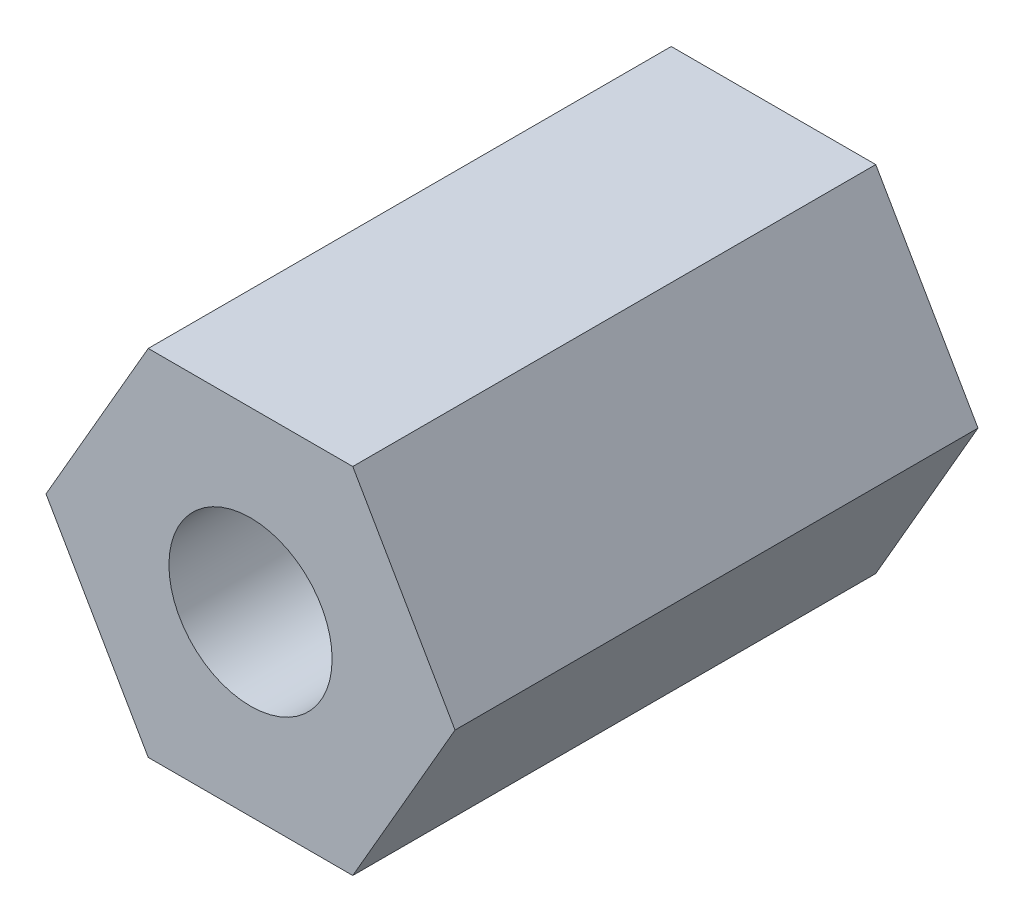
ISO-10303-21;
HEADER;
FILE_DESCRIPTION(('STEP AP214'),'2;1');
FILE_NAME('part.step','',(''),(''),'','','');
FILE_SCHEMA(('AUTOMOTIVE_DESIGN { 1 0 10303 214 1 1 1 1 }'));
ENDSEC;
DATA;
#1=APPLICATION_CONTEXT('core data for automotive mechanical design processes');
#2=APPLICATION_PROTOCOL_DEFINITION('international standard','automotive_design',2000,#1);
#3=PRODUCT_CONTEXT('',#1,'mechanical');
#4=PRODUCT('Part','Part','',(#3));
#5=PRODUCT_RELATED_PRODUCT_CATEGORY('part','',(#4));
#6=PRODUCT_DEFINITION_FORMATION('','',#4);
#7=PRODUCT_DEFINITION_CONTEXT('part definition',#1,'design');
#8=PRODUCT_DEFINITION('design','',#6,#7);
#9=PRODUCT_DEFINITION_SHAPE('','',#8);
#10=(LENGTH_UNIT() NAMED_UNIT(*) SI_UNIT(.MILLI.,.METRE.));
#11=(NAMED_UNIT(*) PLANE_ANGLE_UNIT() SI_UNIT($,.RADIAN.));
#12=(NAMED_UNIT(*) SI_UNIT($,.STERADIAN.) SOLID_ANGLE_UNIT());
#13=UNCERTAINTY_MEASURE_WITH_UNIT(LENGTH_MEASURE(1.E-05),#10,'distance_accuracy_value','');
#14=(GEOMETRIC_REPRESENTATION_CONTEXT(3) GLOBAL_UNCERTAINTY_ASSIGNED_CONTEXT((#13)) GLOBAL_UNIT_ASSIGNED_CONTEXT((#10,
#11,#12)) REPRESENTATION_CONTEXT('',''));
#15=CARTESIAN_POINT('',(0.,0.,0.));
#16=DIRECTION('',(0.,0.,1.));
#17=DIRECTION('',(1.,0.,0.));
#18=AXIS2_PLACEMENT_3D('',#15,#16,#17);
#19=CARTESIAN_POINT('',(0.,0.,-1.01835));
#20=DIRECTION('',(0.,0.,1.));
#21=DIRECTION('',(-1.,0.,0.));
#22=AXIS2_PLACEMENT_3D('',#19,#20,#21);
#23=CYLINDRICAL_SURFACE('',#22,1.025);
#24=CARTESIAN_POINT('',(0.,0.,0.));
#25=DIRECTION('',(0.,0.,1.));
#26=DIRECTION('',(-1.,0.,0.));
#27=AXIS2_PLACEMENT_3D('',#24,#25,#26);
#28=CIRCLE('',#27,1.025);
#29=CARTESIAN_POINT('',(-1.025,0.,0.));
#30=VERTEX_POINT('',#29);
#31=CARTESIAN_POINT('',(1.025,0.,0.));
#32=VERTEX_POINT('',#31);
#33=EDGE_CURVE('E108',#30,#32,#28,.T.);
#34=ORIENTED_EDGE('',*,*,#33,.F.);
#35=CARTESIAN_POINT('',(0.,0.,0.));
#36=DIRECTION('',(0.,0.,1.));
#37=DIRECTION('',(-1.,0.,0.));
#38=AXIS2_PLACEMENT_3D('',#35,#36,#37);
#39=CIRCLE('',#38,1.025);
#40=EDGE_CURVE('E104',#32,#30,#39,.T.);
#41=ORIENTED_EDGE('',*,*,#40,.F.);
#42=DIRECTION('',(0.,0.,1.));
#43=VECTOR('',#42,1.);
#44=CARTESIAN_POINT('',(1.025,0.,-1.01835));
#45=LINE('',#44,#43);
#46=CARTESIAN_POINT('',(1.025,0.,6.57));
#47=VERTEX_POINT('',#46);
#48=EDGE_CURVE('E11',#32,#47,#45,.T.);
#49=ORIENTED_EDGE('',*,*,#48,.T.);
#50=CARTESIAN_POINT('',(0.,0.,6.57));
#51=DIRECTION('',(0.,0.,1.));
#52=DIRECTION('',(-1.,0.,0.));
#53=AXIS2_PLACEMENT_3D('',#50,#51,#52);
#54=CIRCLE('',#53,1.025);
#55=CARTESIAN_POINT('',(-1.025,0.,6.57));
#56=VERTEX_POINT('',#55);
#57=EDGE_CURVE('E20',#47,#56,#54,.T.);
#58=ORIENTED_EDGE('',*,*,#57,.T.);
#59=CARTESIAN_POINT('',(0.,0.,6.57));
#60=DIRECTION('',(0.,0.,1.));
#61=DIRECTION('',(-1.,0.,0.));
#62=AXIS2_PLACEMENT_3D('',#59,#60,#61);
#63=CIRCLE('',#62,1.025);
#64=EDGE_CURVE('E155',#56,#47,#63,.T.);
#65=ORIENTED_EDGE('',*,*,#64,.T.);
#66=ORIENTED_EDGE('',*,*,#48,.F.);
#67=EDGE_LOOP('',(#34,#41,#49,#58,#65,#66));
#68=FACE_BOUND('',#67,.T.);
#69=ADVANCED_FACE('F16',(#68),#23,.F.);
#70=CARTESIAN_POINT('',(0.,0.,6.57));
#71=DIRECTION('',(0.,0.,1.));
#72=DIRECTION('',(1.,0.,0.));
#73=AXIS2_PLACEMENT_3D('',#70,#71,#72);
#74=PLANE('',#73);
#75=ORIENTED_EDGE('',*,*,#64,.F.);
#76=ORIENTED_EDGE('',*,*,#57,.F.);
#77=EDGE_LOOP('',(#75,#76));
#78=FACE_BOUND('',#77,.T.);
#79=DIRECTION('',(0.500000000000017,-0.866025403784429,0.));
#80=VECTOR('',#79,1.);
#81=CARTESIAN_POINT('',(-2.569208697894,0.,6.57));
#82=LINE('',#81,#80);
#83=CARTESIAN_POINT('',(-2.569208697894,0.,6.57));
#84=VERTEX_POINT('',#83);
#85=CARTESIAN_POINT('',(-1.284604348947,-2.225,6.57));
#86=VERTEX_POINT('',#85);
#87=EDGE_CURVE('E141',#84,#86,#82,.T.);
#88=ORIENTED_EDGE('',*,*,#87,.T.);
#89=DIRECTION('',(1.,0.,0.));
#90=VECTOR('',#89,1.);
#91=CARTESIAN_POINT('',(-1.284604348947,-2.225,6.57));
#92=LINE('',#91,#90);
#93=CARTESIAN_POINT('',(1.284604348947,-2.225,6.57));
#94=VERTEX_POINT('',#93);
#95=EDGE_CURVE('E151',#86,#94,#92,.T.);
#96=ORIENTED_EDGE('',*,*,#95,.T.);
#97=DIRECTION('',(0.500000000000017,0.866025403784429,0.));
#98=VECTOR('',#97,1.);
#99=CARTESIAN_POINT('',(1.284604348947,-2.225,6.57));
#100=LINE('',#99,#98);
#101=CARTESIAN_POINT('',(2.569208697894,0.,6.57));
#102=VERTEX_POINT('',#101);
#103=EDGE_CURVE('E180',#94,#102,#100,.T.);
#104=ORIENTED_EDGE('',*,*,#103,.T.);
#105=DIRECTION('',(-0.500000000000017,0.866025403784429,0.));
#106=VECTOR('',#105,1.);
#107=CARTESIAN_POINT('',(2.569208697894,0.,6.57));
#108=LINE('',#107,#106);
#109=CARTESIAN_POINT('',(1.284604348947,2.225,6.57));
#110=VERTEX_POINT('',#109);
#111=EDGE_CURVE('E52',#102,#110,#108,.T.);
#112=ORIENTED_EDGE('',*,*,#111,.T.);
#113=DIRECTION('',(-1.,0.,0.));
#114=VECTOR('',#113,1.);
#115=CARTESIAN_POINT('',(1.284604348947,2.225,6.57));
#116=LINE('',#115,#114);
#117=CARTESIAN_POINT('',(-1.284604348947,2.225,6.57));
#118=VERTEX_POINT('',#117);
#119=EDGE_CURVE('E64',#110,#118,#116,.T.);
#120=ORIENTED_EDGE('',*,*,#119,.T.);
#121=DIRECTION('',(-0.500000000000017,-0.866025403784429,0.));
#122=VECTOR('',#121,1.);
#123=CARTESIAN_POINT('',(-1.284604348947,2.225,6.57));
#124=LINE('',#123,#122);
#125=EDGE_CURVE('E124',#118,#84,#124,.T.);
#126=ORIENTED_EDGE('',*,*,#125,.T.);
#127=EDGE_LOOP('',(#88,#96,#104,#112,#120,#126));
#128=FACE_BOUND('',#127,.T.);
#129=ADVANCED_FACE('F193',(#78,#128),#74,.T.);
#130=CARTESIAN_POINT('',(-1.284604348947,-2.225,0.));
#131=DIRECTION('',(0.,-1.,0.));
#132=DIRECTION('',(0.,0.,-1.));
#133=AXIS2_PLACEMENT_3D('',#130,#131,#132);
#134=PLANE('',#133);
#135=DIRECTION('',(1.,0.,0.));
#136=VECTOR('',#135,1.);
#137=CARTESIAN_POINT('',(-1.284604348947,-2.225,0.));
#138=LINE('',#137,#136);
#139=CARTESIAN_POINT('',(-1.284604348947,-2.225,0.));
#140=VERTEX_POINT('',#139);
#141=CARTESIAN_POINT('',(1.284604348947,-2.225,0.));
#142=VERTEX_POINT('',#141);
#143=EDGE_CURVE('E114',#140,#142,#138,.T.);
#144=ORIENTED_EDGE('',*,*,#143,.T.);
#145=DIRECTION('',(0.,0.,1.));
#146=VECTOR('',#145,1.);
#147=CARTESIAN_POINT('',(1.284604348947,-2.225,0.));
#148=LINE('',#147,#146);
#149=EDGE_CURVE('E156',#142,#94,#148,.T.);
#150=ORIENTED_EDGE('',*,*,#149,.T.);
#151=ORIENTED_EDGE('',*,*,#95,.F.);
#152=DIRECTION('',(0.,0.,1.));
#153=VECTOR('',#152,1.);
#154=CARTESIAN_POINT('',(-1.284604348947,-2.225,0.));
#155=LINE('',#154,#153);
#156=EDGE_CURVE('E110',#140,#86,#155,.T.);
#157=ORIENTED_EDGE('',*,*,#156,.F.);
#158=EDGE_LOOP('',(#144,#150,#151,#157));
#159=FACE_BOUND('',#158,.T.);
#160=ADVANCED_FACE('F189',(#159),#134,.T.);
#161=CARTESIAN_POINT('',(1.284604348947,-2.225,0.));
#162=DIRECTION('',(0.866025403784429,-0.500000000000017,0.));
#163=DIRECTION('',(0.,0.,-1.));
#164=AXIS2_PLACEMENT_3D('',#161,#162,#163);
#165=PLANE('',#164);
#166=DIRECTION('',(0.500000000000017,0.866025403784429,0.));
#167=VECTOR('',#166,1.);
#168=CARTESIAN_POINT('',(1.284604348947,-2.225,0.));
#169=LINE('',#168,#167);
#170=CARTESIAN_POINT('',(2.569208697894,0.,0.));
#171=VERTEX_POINT('',#170);
#172=EDGE_CURVE('E120',#142,#171,#169,.T.);
#173=ORIENTED_EDGE('',*,*,#172,.T.);
#174=DIRECTION('',(0.,0.,1.));
#175=VECTOR('',#174,1.);
#176=CARTESIAN_POINT('',(2.569208697894,0.,0.));
#177=LINE('',#176,#175);
#178=EDGE_CURVE('E150',#171,#102,#177,.T.);
#179=ORIENTED_EDGE('',*,*,#178,.T.);
#180=ORIENTED_EDGE('',*,*,#103,.F.);
#181=ORIENTED_EDGE('',*,*,#149,.F.);
#182=EDGE_LOOP('',(#173,#179,#180,#181));
#183=FACE_BOUND('',#182,.T.);
#184=ADVANCED_FACE('F18',(#183),#165,.T.);
#185=CARTESIAN_POINT('',(2.569208697894,0.,0.));
#186=DIRECTION('',(0.866025403784429,0.500000000000017,0.));
#187=DIRECTION('',(0.,0.,-1.));
#188=AXIS2_PLACEMENT_3D('',#185,#186,#187);
#189=PLANE('',#188);
#190=DIRECTION('',(-0.500000000000017,0.866025403784429,0.));
#191=VECTOR('',#190,1.);
#192=CARTESIAN_POINT('',(2.569208697894,0.,0.));
#193=LINE('',#192,#191);
#194=CARTESIAN_POINT('',(1.284604348947,2.225,0.));
#195=VERTEX_POINT('',#194);
#196=EDGE_CURVE('E134',#171,#195,#193,.T.);
#197=ORIENTED_EDGE('',*,*,#196,.T.);
#198=DIRECTION('',(0.,0.,1.));
#199=VECTOR('',#198,1.);
#200=CARTESIAN_POINT('',(1.284604348947,2.225,0.));
#201=LINE('',#200,#199);
#202=EDGE_CURVE('E144',#195,#110,#201,.T.);
#203=ORIENTED_EDGE('',*,*,#202,.T.);
#204=ORIENTED_EDGE('',*,*,#111,.F.);
#205=ORIENTED_EDGE('',*,*,#178,.F.);
#206=EDGE_LOOP('',(#197,#203,#204,#205));
#207=FACE_BOUND('',#206,.T.);
#208=ADVANCED_FACE('F217',(#207),#189,.T.);
#209=CARTESIAN_POINT('',(1.284604348947,2.225,0.));
#210=DIRECTION('',(0.,1.,0.));
#211=DIRECTION('',(1.,0.,0.));
#212=AXIS2_PLACEMENT_3D('',#209,#210,#211);
#213=PLANE('',#212);
#214=DIRECTION('',(-1.,0.,0.));
#215=VECTOR('',#214,1.);
#216=CARTESIAN_POINT('',(1.284604348947,2.225,0.));
#217=LINE('',#216,#215);
#218=CARTESIAN_POINT('',(-1.284604348947,2.225,0.));
#219=VERTEX_POINT('',#218);
#220=EDGE_CURVE('E132',#195,#219,#217,.T.);
#221=ORIENTED_EDGE('',*,*,#220,.T.);
#222=DIRECTION('',(0.,0.,1.));
#223=VECTOR('',#222,1.);
#224=CARTESIAN_POINT('',(-1.284604348947,2.225,0.));
#225=LINE('',#224,#223);
#226=EDGE_CURVE('E125',#219,#118,#225,.T.);
#227=ORIENTED_EDGE('',*,*,#226,.T.);
#228=ORIENTED_EDGE('',*,*,#119,.F.);
#229=ORIENTED_EDGE('',*,*,#202,.F.);
#230=EDGE_LOOP('',(#221,#227,#228,#229));
#231=FACE_BOUND('',#230,.T.);
#232=ADVANCED_FACE('F211',(#231),#213,.T.);
#233=CARTESIAN_POINT('',(-1.284604348947,2.225,0.));
#234=DIRECTION('',(-0.866025403784429,0.500000000000017,0.));
#235=DIRECTION('',(0.,0.,1.));
#236=AXIS2_PLACEMENT_3D('',#233,#234,#235);
#237=PLANE('',#236);
#238=DIRECTION('',(-0.500000000000017,-0.866025403784429,0.));
#239=VECTOR('',#238,1.);
#240=CARTESIAN_POINT('',(-1.284604348947,2.225,0.));
#241=LINE('',#240,#239);
#242=CARTESIAN_POINT('',(-2.569208697894,0.,0.));
#243=VERTEX_POINT('',#242);
#244=EDGE_CURVE('E128',#219,#243,#241,.T.);
#245=ORIENTED_EDGE('',*,*,#244,.T.);
#246=DIRECTION('',(0.,0.,1.));
#247=VECTOR('',#246,1.);
#248=CARTESIAN_POINT('',(-2.569208697894,0.,0.));
#249=LINE('',#248,#247);
#250=EDGE_CURVE('E126',#243,#84,#249,.T.);
#251=ORIENTED_EDGE('',*,*,#250,.T.);
#252=ORIENTED_EDGE('',*,*,#125,.F.);
#253=ORIENTED_EDGE('',*,*,#226,.F.);
#254=EDGE_LOOP('',(#245,#251,#252,#253));
#255=FACE_BOUND('',#254,.T.);
#256=ADVANCED_FACE('F209',(#255),#237,.T.);
#257=CARTESIAN_POINT('',(-2.569208697894,0.,0.));
#258=DIRECTION('',(-0.866025403784429,-0.500000000000017,0.));
#259=DIRECTION('',(-0.500000000000017,0.866025403784429,0.));
#260=AXIS2_PLACEMENT_3D('',#257,#258,#259);
#261=PLANE('',#260);
#262=DIRECTION('',(0.500000000000017,-0.866025403784429,0.));
#263=VECTOR('',#262,1.);
#264=CARTESIAN_POINT('',(-2.569208697894,0.,0.));
#265=LINE('',#264,#263);
#266=EDGE_CURVE('E133',#243,#140,#265,.T.);
#267=ORIENTED_EDGE('',*,*,#266,.T.);
#268=ORIENTED_EDGE('',*,*,#156,.T.);
#269=ORIENTED_EDGE('',*,*,#87,.F.);
#270=ORIENTED_EDGE('',*,*,#250,.F.);
#271=EDGE_LOOP('',(#267,#268,#269,#270));
#272=FACE_BOUND('',#271,.T.);
#273=ADVANCED_FACE('F206',(#272),#261,.T.);
#274=CARTESIAN_POINT('',(0.,0.,0.));
#275=DIRECTION('',(0.,0.,1.));
#276=DIRECTION('',(1.,0.,0.));
#277=AXIS2_PLACEMENT_3D('',#274,#275,#276);
#278=PLANE('',#277);
#279=ORIENTED_EDGE('',*,*,#33,.T.);
#280=ORIENTED_EDGE('',*,*,#40,.T.);
#281=EDGE_LOOP('',(#279,#280));
#282=FACE_BOUND('',#281,.T.);
#283=ORIENTED_EDGE('',*,*,#266,.F.);
#284=ORIENTED_EDGE('',*,*,#244,.F.);
#285=ORIENTED_EDGE('',*,*,#220,.F.);
#286=ORIENTED_EDGE('',*,*,#196,.F.);
#287=ORIENTED_EDGE('',*,*,#172,.F.);
#288=ORIENTED_EDGE('',*,*,#143,.F.);
#289=EDGE_LOOP('',(#283,#284,#285,#286,#287,#288));
#290=FACE_BOUND('',#289,.T.);
#291=ADVANCED_FACE('F106',(#282,#290),#278,.F.);
#292=CLOSED_SHELL('',(#69,#129,#160,#184,#208,#232,#256,#273,#291));
#293=MANIFOLD_SOLID_BREP('B1',#292);
#294=ADVANCED_BREP_SHAPE_REPRESENTATION('',(#18,#293),#14);
#295=SHAPE_DEFINITION_REPRESENTATION(#9,#294);
ENDSEC;
END-ISO-10303-21;
